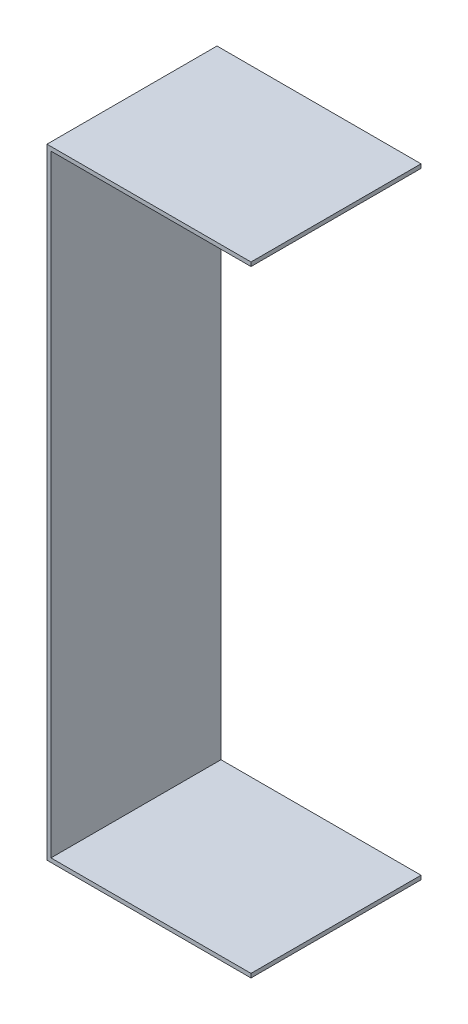
ISO-10303-21;
HEADER;
FILE_DESCRIPTION(('STEP AP214'),'2;1');
FILE_NAME('part.step','',(''),(''),'','','');
FILE_SCHEMA(('AUTOMOTIVE_DESIGN { 1 0 10303 214 1 1 1 1 }'));
ENDSEC;
DATA;
#1=APPLICATION_CONTEXT('core data for automotive mechanical design processes');
#2=APPLICATION_PROTOCOL_DEFINITION('international standard','automotive_design',2000,#1);
#3=PRODUCT_CONTEXT('',#1,'mechanical');
#4=PRODUCT('Part','Part','',(#3));
#5=PRODUCT_RELATED_PRODUCT_CATEGORY('part','',(#4));
#6=PRODUCT_DEFINITION_FORMATION('','',#4);
#7=PRODUCT_DEFINITION_CONTEXT('part definition',#1,'design');
#8=PRODUCT_DEFINITION('design','',#6,#7);
#9=PRODUCT_DEFINITION_SHAPE('','',#8);
#10=(LENGTH_UNIT() NAMED_UNIT(*) SI_UNIT(.MILLI.,.METRE.));
#11=(NAMED_UNIT(*) PLANE_ANGLE_UNIT() SI_UNIT($,.RADIAN.));
#12=(NAMED_UNIT(*) SI_UNIT($,.STERADIAN.) SOLID_ANGLE_UNIT());
#13=UNCERTAINTY_MEASURE_WITH_UNIT(LENGTH_MEASURE(1.E-05),#10,'distance_accuracy_value','');
#14=(GEOMETRIC_REPRESENTATION_CONTEXT(3) GLOBAL_UNCERTAINTY_ASSIGNED_CONTEXT((#13)) GLOBAL_UNIT_ASSIGNED_CONTEXT((#10,
#11,#12)) REPRESENTATION_CONTEXT('',''));
#15=CARTESIAN_POINT('',(0.,0.,0.));
#16=DIRECTION('',(0.,0.,1.));
#17=DIRECTION('',(1.,0.,0.));
#18=AXIS2_PLACEMENT_3D('',#15,#16,#17);
#19=CARTESIAN_POINT('',(0.,0.,85.));
#20=DIRECTION('',(0.,-1.,0.));
#21=DIRECTION('',(0.,0.,-1.));
#22=AXIS2_PLACEMENT_3D('',#19,#20,#21);
#23=PLANE('',#22);
#24=DIRECTION('',(-1.,0.,0.));
#25=VECTOR('',#24,1.);
#26=CARTESIAN_POINT('',(0.,0.,0.));
#27=LINE('',#26,#25);
#28=CARTESIAN_POINT('',(100.,0.,0.));
#29=VERTEX_POINT('',#28);
#30=CARTESIAN_POINT('',(0.,0.,0.));
#31=VERTEX_POINT('',#30);
#32=EDGE_CURVE('E129',#29,#31,#27,.T.);
#33=ORIENTED_EDGE('',*,*,#32,.T.);
#34=DIRECTION('',(0.,0.,-1.));
#35=VECTOR('',#34,1.);
#36=CARTESIAN_POINT('',(0.,0.,85.));
#37=LINE('',#36,#35);
#38=CARTESIAN_POINT('',(0.,0.,85.));
#39=VERTEX_POINT('',#38);
#40=EDGE_CURVE('E11',#39,#31,#37,.T.);
#41=ORIENTED_EDGE('',*,*,#40,.F.);
#42=DIRECTION('',(-1.,0.,0.));
#43=VECTOR('',#42,1.);
#44=CARTESIAN_POINT('',(0.,0.,85.));
#45=LINE('',#44,#43);
#46=CARTESIAN_POINT('',(100.,0.,85.));
#47=VERTEX_POINT('',#46);
#48=EDGE_CURVE('E143',#47,#39,#45,.T.);
#49=ORIENTED_EDGE('',*,*,#48,.F.);
#50=DIRECTION('',(0.,0.,-1.));
#51=VECTOR('',#50,1.);
#52=CARTESIAN_POINT('',(100.,0.,85.));
#53=LINE('',#52,#51);
#54=EDGE_CURVE('E125',#47,#29,#53,.T.);
#55=ORIENTED_EDGE('',*,*,#54,.T.);
#56=EDGE_LOOP('',(#33,#41,#49,#55));
#57=FACE_BOUND('',#56,.T.);
#58=ADVANCED_FACE('F33',(#57),#23,.F.);
#59=CARTESIAN_POINT('',(0.,0.,85.));
#60=DIRECTION('',(-1.,0.,0.));
#61=DIRECTION('',(0.,0.,1.));
#62=AXIS2_PLACEMENT_3D('',#59,#60,#61);
#63=PLANE('',#62);
#64=DIRECTION('',(0.,1.,0.));
#65=VECTOR('',#64,1.);
#66=CARTESIAN_POINT('',(0.,0.,0.));
#67=LINE('',#66,#65);
#68=CARTESIAN_POINT('',(0.,306.,0.));
#69=VERTEX_POINT('',#68);
#70=EDGE_CURVE('E132',#31,#69,#67,.T.);
#71=ORIENTED_EDGE('',*,*,#70,.T.);
#72=DIRECTION('',(0.,0.,-1.));
#73=VECTOR('',#72,1.);
#74=CARTESIAN_POINT('',(0.,306.,85.));
#75=LINE('',#74,#73);
#76=CARTESIAN_POINT('',(0.,306.,85.));
#77=VERTEX_POINT('',#76);
#78=EDGE_CURVE('E41',#77,#69,#75,.T.);
#79=ORIENTED_EDGE('',*,*,#78,.F.);
#80=DIRECTION('',(0.,1.,0.));
#81=VECTOR('',#80,1.);
#82=CARTESIAN_POINT('',(0.,0.,85.));
#83=LINE('',#82,#81);
#84=EDGE_CURVE('E92',#39,#77,#83,.T.);
#85=ORIENTED_EDGE('',*,*,#84,.F.);
#86=ORIENTED_EDGE('',*,*,#40,.T.);
#87=EDGE_LOOP('',(#71,#79,#85,#86));
#88=FACE_BOUND('',#87,.T.);
#89=ADVANCED_FACE('F178',(#88),#63,.F.);
#90=CARTESIAN_POINT('',(0.,306.,85.));
#91=DIRECTION('',(0.,1.,0.));
#92=DIRECTION('',(0.,0.,1.));
#93=AXIS2_PLACEMENT_3D('',#90,#91,#92);
#94=PLANE('',#93);
#95=DIRECTION('',(1.,0.,0.));
#96=VECTOR('',#95,1.);
#97=CARTESIAN_POINT('',(0.,306.,0.));
#98=LINE('',#97,#96);
#99=CARTESIAN_POINT('',(100.,306.,0.));
#100=VERTEX_POINT('',#99);
#101=EDGE_CURVE('E134',#69,#100,#98,.T.);
#102=ORIENTED_EDGE('',*,*,#101,.T.);
#103=DIRECTION('',(0.,0.,-1.));
#104=VECTOR('',#103,1.);
#105=CARTESIAN_POINT('',(100.,306.,85.));
#106=LINE('',#105,#104);
#107=CARTESIAN_POINT('',(100.,306.,85.));
#108=VERTEX_POINT('',#107);
#109=EDGE_CURVE('E150',#108,#100,#106,.T.);
#110=ORIENTED_EDGE('',*,*,#109,.F.);
#111=DIRECTION('',(1.,0.,0.));
#112=VECTOR('',#111,1.);
#113=CARTESIAN_POINT('',(0.,306.,85.));
#114=LINE('',#113,#112);
#115=EDGE_CURVE('E158',#77,#108,#114,.T.);
#116=ORIENTED_EDGE('',*,*,#115,.F.);
#117=ORIENTED_EDGE('',*,*,#78,.T.);
#118=EDGE_LOOP('',(#102,#110,#116,#117));
#119=FACE_BOUND('',#118,.T.);
#120=ADVANCED_FACE('F156',(#119),#94,.F.);
#121=CARTESIAN_POINT('',(100.,308.,85.));
#122=DIRECTION('',(-1.,0.,0.));
#123=DIRECTION('',(0.,0.,1.));
#124=AXIS2_PLACEMENT_3D('',#121,#122,#123);
#125=PLANE('',#124);
#126=DIRECTION('',(0.,1.,0.));
#127=VECTOR('',#126,1.);
#128=CARTESIAN_POINT('',(100.,308.,0.));
#129=LINE('',#128,#127);
#130=CARTESIAN_POINT('',(100.,308.,0.));
#131=VERTEX_POINT('',#130);
#132=EDGE_CURVE('E136',#100,#131,#129,.T.);
#133=ORIENTED_EDGE('',*,*,#132,.T.);
#134=DIRECTION('',(0.,0.,-1.));
#135=VECTOR('',#134,1.);
#136=CARTESIAN_POINT('',(100.,308.,85.));
#137=LINE('',#136,#135);
#138=CARTESIAN_POINT('',(100.,308.,85.));
#139=VERTEX_POINT('',#138);
#140=EDGE_CURVE('E147',#139,#131,#137,.T.);
#141=ORIENTED_EDGE('',*,*,#140,.F.);
#142=DIRECTION('',(0.,1.,0.));
#143=VECTOR('',#142,1.);
#144=CARTESIAN_POINT('',(100.,308.,85.));
#145=LINE('',#144,#143);
#146=EDGE_CURVE('E170',#108,#139,#145,.T.);
#147=ORIENTED_EDGE('',*,*,#146,.F.);
#148=ORIENTED_EDGE('',*,*,#109,.T.);
#149=EDGE_LOOP('',(#133,#141,#147,#148));
#150=FACE_BOUND('',#149,.T.);
#151=ADVANCED_FACE('F166',(#150),#125,.F.);
#152=CARTESIAN_POINT('',(-2.,308.,85.));
#153=DIRECTION('',(0.,-1.,0.));
#154=DIRECTION('',(0.,0.,-1.));
#155=AXIS2_PLACEMENT_3D('',#152,#153,#154);
#156=PLANE('',#155);
#157=DIRECTION('',(-1.,0.,0.));
#158=VECTOR('',#157,1.);
#159=CARTESIAN_POINT('',(-2.,308.,0.));
#160=LINE('',#159,#158);
#161=CARTESIAN_POINT('',(-2.,308.,0.));
#162=VERTEX_POINT('',#161);
#163=EDGE_CURVE('E138',#131,#162,#160,.T.);
#164=ORIENTED_EDGE('',*,*,#163,.T.);
#165=DIRECTION('',(0.,0.,-1.));
#166=VECTOR('',#165,1.);
#167=CARTESIAN_POINT('',(-2.,308.,85.));
#168=LINE('',#167,#166);
#169=CARTESIAN_POINT('',(-2.,308.,85.));
#170=VERTEX_POINT('',#169);
#171=EDGE_CURVE('E120',#170,#162,#168,.T.);
#172=ORIENTED_EDGE('',*,*,#171,.F.);
#173=DIRECTION('',(-1.,0.,0.));
#174=VECTOR('',#173,1.);
#175=CARTESIAN_POINT('',(-2.,308.,85.));
#176=LINE('',#175,#174);
#177=EDGE_CURVE('E111',#139,#170,#176,.T.);
#178=ORIENTED_EDGE('',*,*,#177,.F.);
#179=ORIENTED_EDGE('',*,*,#140,.T.);
#180=EDGE_LOOP('',(#164,#172,#178,#179));
#181=FACE_BOUND('',#180,.T.);
#182=ADVANCED_FACE('F169',(#181),#156,.F.);
#183=CARTESIAN_POINT('',(-2.,-2.,85.));
#184=DIRECTION('',(1.,0.,0.));
#185=DIRECTION('',(0.,0.,-1.));
#186=AXIS2_PLACEMENT_3D('',#183,#184,#185);
#187=PLANE('',#186);
#188=DIRECTION('',(0.,-1.,0.));
#189=VECTOR('',#188,1.);
#190=CARTESIAN_POINT('',(-2.,-2.,0.));
#191=LINE('',#190,#189);
#192=CARTESIAN_POINT('',(-2.,-2.,0.));
#193=VERTEX_POINT('',#192);
#194=EDGE_CURVE('E119',#162,#193,#191,.T.);
#195=ORIENTED_EDGE('',*,*,#194,.T.);
#196=DIRECTION('',(0.,0.,-1.));
#197=VECTOR('',#196,1.);
#198=CARTESIAN_POINT('',(-2.,-2.,85.));
#199=LINE('',#198,#197);
#200=CARTESIAN_POINT('',(-2.,-2.,85.));
#201=VERTEX_POINT('',#200);
#202=EDGE_CURVE('E116',#201,#193,#199,.T.);
#203=ORIENTED_EDGE('',*,*,#202,.F.);
#204=DIRECTION('',(0.,-1.,0.));
#205=VECTOR('',#204,1.);
#206=CARTESIAN_POINT('',(-2.,-2.,85.));
#207=LINE('',#206,#205);
#208=EDGE_CURVE('E105',#170,#201,#207,.T.);
#209=ORIENTED_EDGE('',*,*,#208,.F.);
#210=ORIENTED_EDGE('',*,*,#171,.T.);
#211=EDGE_LOOP('',(#195,#203,#209,#210));
#212=FACE_BOUND('',#211,.T.);
#213=ADVANCED_FACE('F117',(#212),#187,.F.);
#214=CARTESIAN_POINT('',(-2.,-2.,85.));
#215=DIRECTION('',(0.,1.,0.));
#216=DIRECTION('',(0.,0.,1.));
#217=AXIS2_PLACEMENT_3D('',#214,#215,#216);
#218=PLANE('',#217);
#219=DIRECTION('',(1.,0.,0.));
#220=VECTOR('',#219,1.);
#221=CARTESIAN_POINT('',(-2.,-2.,0.));
#222=LINE('',#221,#220);
#223=CARTESIAN_POINT('',(100.,-2.,0.));
#224=VERTEX_POINT('',#223);
#225=EDGE_CURVE('E78',#193,#224,#222,.T.);
#226=ORIENTED_EDGE('',*,*,#225,.T.);
#227=DIRECTION('',(0.,0.,-1.));
#228=VECTOR('',#227,1.);
#229=CARTESIAN_POINT('',(100.,-2.,85.));
#230=LINE('',#229,#228);
#231=CARTESIAN_POINT('',(100.,-2.,85.));
#232=VERTEX_POINT('',#231);
#233=EDGE_CURVE('E121',#232,#224,#230,.T.);
#234=ORIENTED_EDGE('',*,*,#233,.F.);
#235=DIRECTION('',(1.,0.,0.));
#236=VECTOR('',#235,1.);
#237=CARTESIAN_POINT('',(-2.,-2.,85.));
#238=LINE('',#237,#236);
#239=EDGE_CURVE('E109',#201,#232,#238,.T.);
#240=ORIENTED_EDGE('',*,*,#239,.F.);
#241=ORIENTED_EDGE('',*,*,#202,.T.);
#242=EDGE_LOOP('',(#226,#234,#240,#241));
#243=FACE_BOUND('',#242,.T.);
#244=ADVANCED_FACE('F123',(#243),#218,.F.);
#245=CARTESIAN_POINT('',(100.,0.,85.));
#246=DIRECTION('',(-1.,0.,0.));
#247=DIRECTION('',(0.,0.,1.));
#248=AXIS2_PLACEMENT_3D('',#245,#246,#247);
#249=PLANE('',#248);
#250=DIRECTION('',(0.,1.,0.));
#251=VECTOR('',#250,1.);
#252=CARTESIAN_POINT('',(100.,0.,0.));
#253=LINE('',#252,#251);
#254=EDGE_CURVE('E84',#224,#29,#253,.T.);
#255=ORIENTED_EDGE('',*,*,#254,.T.);
#256=ORIENTED_EDGE('',*,*,#54,.F.);
#257=DIRECTION('',(0.,1.,0.));
#258=VECTOR('',#257,1.);
#259=CARTESIAN_POINT('',(100.,0.,85.));
#260=LINE('',#259,#258);
#261=EDGE_CURVE('E49',#232,#47,#260,.T.);
#262=ORIENTED_EDGE('',*,*,#261,.F.);
#263=ORIENTED_EDGE('',*,*,#233,.T.);
#264=EDGE_LOOP('',(#255,#256,#262,#263));
#265=FACE_BOUND('',#264,.T.);
#266=ADVANCED_FACE('F194',(#265),#249,.F.);
#267=CARTESIAN_POINT('',(0.,0.,85.));
#268=DIRECTION('',(0.,0.,-1.));
#269=DIRECTION('',(-1.,0.,0.));
#270=AXIS2_PLACEMENT_3D('',#267,#268,#269);
#271=PLANE('',#270);
#272=ORIENTED_EDGE('',*,*,#48,.T.);
#273=ORIENTED_EDGE('',*,*,#84,.T.);
#274=ORIENTED_EDGE('',*,*,#115,.T.);
#275=ORIENTED_EDGE('',*,*,#146,.T.);
#276=ORIENTED_EDGE('',*,*,#177,.T.);
#277=ORIENTED_EDGE('',*,*,#208,.T.);
#278=ORIENTED_EDGE('',*,*,#239,.T.);
#279=ORIENTED_EDGE('',*,*,#261,.T.);
#280=EDGE_LOOP('',(#272,#273,#274,#275,#276,#277,#278,#279));
#281=FACE_BOUND('',#280,.T.);
#282=ADVANCED_FACE('F107',(#281),#271,.F.);
#283=CARTESIAN_POINT('',(0.,0.,0.));
#284=DIRECTION('',(0.,0.,-1.));
#285=DIRECTION('',(-1.,0.,0.));
#286=AXIS2_PLACEMENT_3D('',#283,#284,#285);
#287=PLANE('',#286);
#288=ORIENTED_EDGE('',*,*,#32,.F.);
#289=ORIENTED_EDGE('',*,*,#254,.F.);
#290=ORIENTED_EDGE('',*,*,#225,.F.);
#291=ORIENTED_EDGE('',*,*,#194,.F.);
#292=ORIENTED_EDGE('',*,*,#163,.F.);
#293=ORIENTED_EDGE('',*,*,#132,.F.);
#294=ORIENTED_EDGE('',*,*,#101,.F.);
#295=ORIENTED_EDGE('',*,*,#70,.F.);
#296=EDGE_LOOP('',(#288,#289,#290,#291,#292,#293,#294,#295));
#297=FACE_BOUND('',#296,.T.);
#298=ADVANCED_FACE('F162',(#297),#287,.T.);
#299=CLOSED_SHELL('',(#58,#89,#120,#151,#182,#213,#244,#266,#282,#298));
#300=MANIFOLD_SOLID_BREP('B2',#299);
#301=ADVANCED_BREP_SHAPE_REPRESENTATION('',(#18,#300),#14);
#302=SHAPE_DEFINITION_REPRESENTATION(#9,#301);
ENDSEC;
END-ISO-10303-21;
